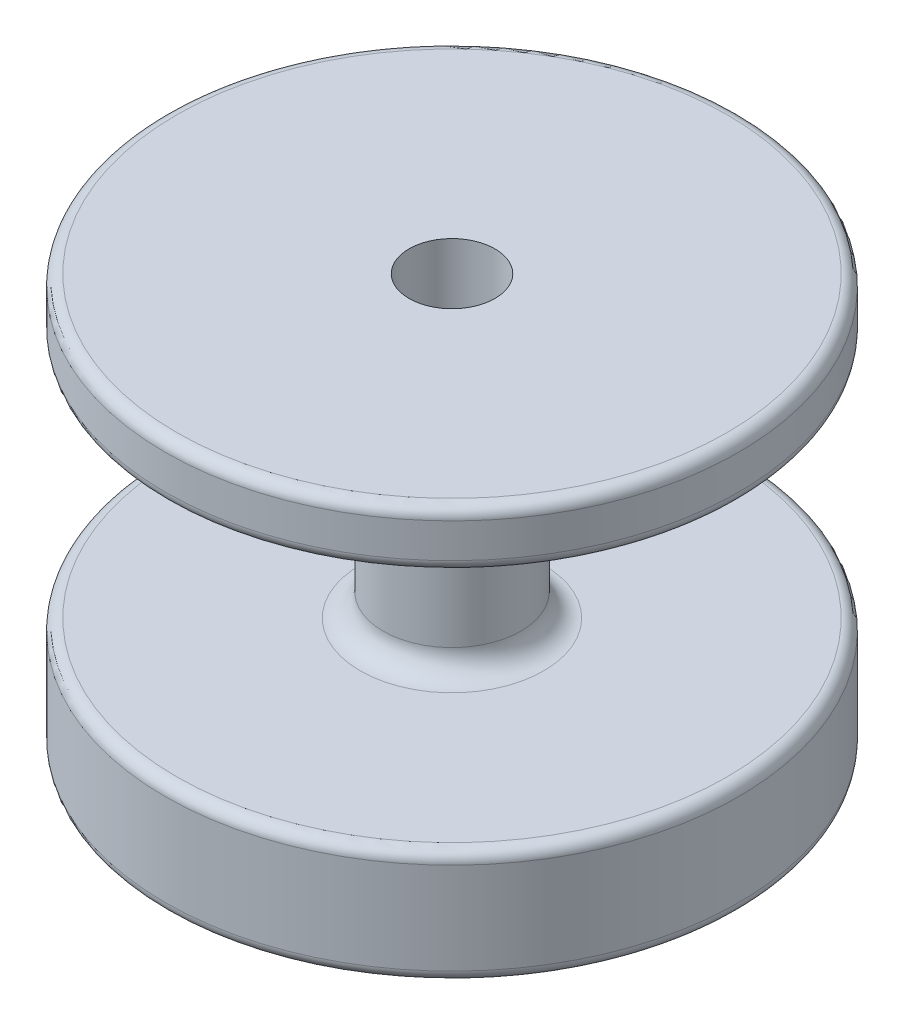
ISO-10303-21;
HEADER;
FILE_DESCRIPTION(('STEP AP214'),'2;1');
FILE_NAME('part.step','',(''),(''),'','','');
FILE_SCHEMA(('AUTOMOTIVE_DESIGN { 1 0 10303 214 1 1 1 1 }'));
ENDSEC;
DATA;
#1=APPLICATION_CONTEXT('core data for automotive mechanical design processes');
#2=APPLICATION_PROTOCOL_DEFINITION('international standard','automotive_design',2000,#1);
#3=PRODUCT_CONTEXT('',#1,'mechanical');
#4=PRODUCT('Part','Part','',(#3));
#5=PRODUCT_RELATED_PRODUCT_CATEGORY('part','',(#4));
#6=PRODUCT_DEFINITION_FORMATION('','',#4);
#7=PRODUCT_DEFINITION_CONTEXT('part definition',#1,'design');
#8=PRODUCT_DEFINITION('design','',#6,#7);
#9=PRODUCT_DEFINITION_SHAPE('','',#8);
#10=(LENGTH_UNIT() NAMED_UNIT(*) SI_UNIT(.MILLI.,.METRE.));
#11=(NAMED_UNIT(*) PLANE_ANGLE_UNIT() SI_UNIT($,.RADIAN.));
#12=(NAMED_UNIT(*) SI_UNIT($,.STERADIAN.) SOLID_ANGLE_UNIT());
#13=UNCERTAINTY_MEASURE_WITH_UNIT(LENGTH_MEASURE(1.E-05),#10,'distance_accuracy_value','');
#14=(GEOMETRIC_REPRESENTATION_CONTEXT(3) GLOBAL_UNCERTAINTY_ASSIGNED_CONTEXT((#13)) GLOBAL_UNIT_ASSIGNED_CONTEXT((#10,
#11,#12)) REPRESENTATION_CONTEXT('',''));
#15=CARTESIAN_POINT('',(0.,0.,0.));
#16=DIRECTION('',(0.,0.,1.));
#17=DIRECTION('',(1.,0.,0.));
#18=AXIS2_PLACEMENT_3D('',#15,#16,#17);
#19=CARTESIAN_POINT('',(0.,47.,0.));
#20=DIRECTION('',(0.,-1.,0.));
#21=DIRECTION('',(0.,0.,-1.));
#22=AXIS2_PLACEMENT_3D('',#19,#20,#21);
#23=CYLINDRICAL_SURFACE('',#22,2.);
#24=CARTESIAN_POINT('',(0.,0.,0.));
#25=DIRECTION('',(0.,1.,0.));
#26=DIRECTION('',(0.,0.,1.));
#27=AXIS2_PLACEMENT_3D('',#24,#25,#26);
#28=CIRCLE('',#27,2.);
#29=CARTESIAN_POINT('',(0.,0.,2.));
#30=VERTEX_POINT('',#29);
#31=EDGE_CURVE('E95',#30,#30,#28,.F.);
#32=ORIENTED_EDGE('',*,*,#31,.T.);
#33=EDGE_LOOP('',(#32));
#34=FACE_BOUND('',#33,.T.);
#35=CARTESIAN_POINT('',(0.,19.,0.));
#36=DIRECTION('',(0.,1.,0.));
#37=DIRECTION('',(0.,0.,1.));
#38=AXIS2_PLACEMENT_3D('',#35,#36,#37);
#39=CIRCLE('',#38,2.);
#40=CARTESIAN_POINT('',(0.,19.,2.));
#41=VERTEX_POINT('',#40);
#42=EDGE_CURVE('E96',#41,#41,#39,.T.);
#43=ORIENTED_EDGE('',*,*,#42,.T.);
#44=EDGE_LOOP('',(#43));
#45=FACE_BOUND('',#44,.T.);
#46=ADVANCED_FACE('F39',(#34,#45),#23,.F.);
#47=CARTESIAN_POINT('',(0.,36.,0.));
#48=DIRECTION('',(0.,-1.,0.));
#49=DIRECTION('',(0.,0.,-1.));
#50=AXIS2_PLACEMENT_3D('',#47,#48,#49);
#51=CYLINDRICAL_SURFACE('',#50,25.);
#52=CARTESIAN_POINT('',(0.,35.,0.));
#53=DIRECTION('',(0.,1.,0.));
#54=DIRECTION('',(0.,0.,1.));
#55=AXIS2_PLACEMENT_3D('',#52,#53,#54);
#56=CIRCLE('',#55,25.);
#57=CARTESIAN_POINT('',(0.,35.,25.));
#58=VERTEX_POINT('',#57);
#59=EDGE_CURVE('E83',#58,#58,#56,.F.);
#60=ORIENTED_EDGE('',*,*,#59,.T.);
#61=EDGE_LOOP('',(#60));
#62=FACE_BOUND('',#61,.T.);
#63=CARTESIAN_POINT('',(0.,32.,0.));
#64=DIRECTION('',(0.,1.,0.));
#65=DIRECTION('',(0.,0.,1.));
#66=AXIS2_PLACEMENT_3D('',#63,#64,#65);
#67=CIRCLE('',#66,25.);
#68=CARTESIAN_POINT('',(0.,32.,25.));
#69=VERTEX_POINT('',#68);
#70=EDGE_CURVE('E87',#69,#69,#67,.T.);
#71=ORIENTED_EDGE('',*,*,#70,.T.);
#72=EDGE_LOOP('',(#71));
#73=FACE_BOUND('',#72,.T.);
#74=ADVANCED_FACE('F124',(#62,#73),#51,.T.);
#75=CARTESIAN_POINT('',(0.,36.,0.));
#76=DIRECTION('',(0.,1.,0.));
#77=DIRECTION('',(0.,0.,1.));
#78=AXIS2_PLACEMENT_3D('',#75,#76,#77);
#79=PLANE('',#78);
#80=CARTESIAN_POINT('',(0.,36.,0.));
#81=DIRECTION('',(0.,1.,0.));
#82=DIRECTION('',(0.,0.,1.));
#83=AXIS2_PLACEMENT_3D('',#80,#81,#82);
#84=CIRCLE('',#83,24.);
#85=CARTESIAN_POINT('',(0.,36.,24.));
#86=VERTEX_POINT('',#85);
#87=EDGE_CURVE('E91',#86,#86,#84,.T.);
#88=ORIENTED_EDGE('',*,*,#87,.T.);
#89=EDGE_LOOP('',(#88));
#90=FACE_BOUND('',#89,.T.);
#91=CARTESIAN_POINT('',(0.,36.,0.));
#92=DIRECTION('',(0.,1.,0.));
#93=DIRECTION('',(0.,0.,1.));
#94=AXIS2_PLACEMENT_3D('',#91,#92,#93);
#95=CIRCLE('',#94,3.75);
#96=CARTESIAN_POINT('',(0.,36.,3.75));
#97=VERTEX_POINT('',#96);
#98=EDGE_CURVE('E104',#97,#97,#95,.T.);
#99=ORIENTED_EDGE('',*,*,#98,.F.);
#100=EDGE_LOOP('',(#99));
#101=FACE_BOUND('',#100,.T.);
#102=ADVANCED_FACE('F121',(#90,#101),#79,.T.);
#103=CARTESIAN_POINT('',(0.,31.,0.));
#104=DIRECTION('',(0.,-1.,0.));
#105=DIRECTION('',(0.,0.,-1.));
#106=AXIS2_PLACEMENT_3D('',#103,#104,#105);
#107=CYLINDRICAL_SURFACE('',#106,6.);
#108=CARTESIAN_POINT('',(0.,29.,0.));
#109=DIRECTION('',(0.,1.,0.));
#110=DIRECTION('',(0.,0.,1.));
#111=AXIS2_PLACEMENT_3D('',#108,#109,#110);
#112=CIRCLE('',#111,6.);
#113=CARTESIAN_POINT('',(0.,29.,6.));
#114=VERTEX_POINT('',#113);
#115=EDGE_CURVE('E47',#114,#114,#112,.F.);
#116=ORIENTED_EDGE('',*,*,#115,.T.);
#117=EDGE_LOOP('',(#116));
#118=FACE_BOUND('',#117,.T.);
#119=CARTESIAN_POINT('',(0.,12.,0.));
#120=DIRECTION('',(0.,1.,0.));
#121=DIRECTION('',(0.,0.,1.));
#122=AXIS2_PLACEMENT_3D('',#119,#120,#121);
#123=CIRCLE('',#122,6.);
#124=CARTESIAN_POINT('',(0.,12.,6.));
#125=VERTEX_POINT('',#124);
#126=EDGE_CURVE('E52',#125,#125,#123,.T.);
#127=ORIENTED_EDGE('',*,*,#126,.T.);
#128=EDGE_LOOP('',(#127));
#129=FACE_BOUND('',#128,.T.);
#130=ADVANCED_FACE('F123',(#118,#129),#107,.T.);
#131=CARTESIAN_POINT('',(0.,31.,0.));
#132=DIRECTION('',(0.,1.,0.));
#133=DIRECTION('',(0.,0.,1.));
#134=AXIS2_PLACEMENT_3D('',#131,#132,#133);
#135=PLANE('',#134);
#136=CARTESIAN_POINT('',(0.,31.,0.));
#137=DIRECTION('',(0.,1.,0.));
#138=DIRECTION('',(0.,0.,1.));
#139=AXIS2_PLACEMENT_3D('',#136,#137,#138);
#140=CIRCLE('',#139,8.);
#141=CARTESIAN_POINT('',(0.,31.,8.));
#142=VERTEX_POINT('',#141);
#143=EDGE_CURVE('E57',#142,#142,#140,.T.);
#144=ORIENTED_EDGE('',*,*,#143,.T.);
#145=EDGE_LOOP('',(#144));
#146=FACE_BOUND('',#145,.T.);
#147=CARTESIAN_POINT('',(0.,31.,0.));
#148=DIRECTION('',(0.,1.,0.));
#149=DIRECTION('',(0.,0.,1.));
#150=AXIS2_PLACEMENT_3D('',#147,#148,#149);
#151=CIRCLE('',#150,24.);
#152=CARTESIAN_POINT('',(0.,31.,24.));
#153=VERTEX_POINT('',#152);
#154=EDGE_CURVE('E79',#153,#153,#151,.F.);
#155=ORIENTED_EDGE('',*,*,#154,.T.);
#156=EDGE_LOOP('',(#155));
#157=FACE_BOUND('',#156,.T.);
#158=ADVANCED_FACE('F131',(#146,#157),#135,.F.);
#159=CARTESIAN_POINT('',(0.,10.,0.));
#160=DIRECTION('',(0.,1.,0.));
#161=DIRECTION('',(0.,0.,1.));
#162=AXIS2_PLACEMENT_3D('',#159,#160,#161);
#163=PLANE('',#162);
#164=CARTESIAN_POINT('',(0.,10.,0.));
#165=DIRECTION('',(0.,1.,0.));
#166=DIRECTION('',(0.,0.,1.));
#167=AXIS2_PLACEMENT_3D('',#164,#165,#166);
#168=CIRCLE('',#167,8.);
#169=CARTESIAN_POINT('',(0.,10.,8.));
#170=VERTEX_POINT('',#169);
#171=EDGE_CURVE('E10',#170,#170,#168,.F.);
#172=ORIENTED_EDGE('',*,*,#171,.T.);
#173=EDGE_LOOP('',(#172));
#174=FACE_BOUND('',#173,.T.);
#175=CARTESIAN_POINT('',(0.,10.,0.));
#176=DIRECTION('',(0.,1.,0.));
#177=DIRECTION('',(0.,0.,1.));
#178=AXIS2_PLACEMENT_3D('',#175,#176,#177);
#179=CIRCLE('',#178,24.);
#180=CARTESIAN_POINT('',(0.,10.,24.));
#181=VERTEX_POINT('',#180);
#182=EDGE_CURVE('E75',#181,#181,#179,.T.);
#183=ORIENTED_EDGE('',*,*,#182,.T.);
#184=EDGE_LOOP('',(#183));
#185=FACE_BOUND('',#184,.T.);
#186=ADVANCED_FACE('F146',(#174,#185),#163,.T.);
#187=CARTESIAN_POINT('',(0.,0.,0.));
#188=DIRECTION('',(0.,1.,0.));
#189=DIRECTION('',(0.,0.,1.));
#190=AXIS2_PLACEMENT_3D('',#187,#188,#189);
#191=PLANE('',#190);
#192=CARTESIAN_POINT('',(0.,0.,0.));
#193=DIRECTION('',(0.,1.,0.));
#194=DIRECTION('',(0.,0.,1.));
#195=AXIS2_PLACEMENT_3D('',#192,#193,#194);
#196=CIRCLE('',#195,24.);
#197=CARTESIAN_POINT('',(0.,0.,24.));
#198=VERTEX_POINT('',#197);
#199=EDGE_CURVE('E63',#198,#198,#196,.F.);
#200=ORIENTED_EDGE('',*,*,#199,.T.);
#201=EDGE_LOOP('',(#200));
#202=FACE_BOUND('',#201,.T.);
#203=ORIENTED_EDGE('',*,*,#31,.F.);
#204=EDGE_LOOP('',(#203));
#205=FACE_BOUND('',#204,.T.);
#206=ADVANCED_FACE('F149',(#202,#205),#191,.F.);
#207=CARTESIAN_POINT('',(0.,9.,0.));
#208=DIRECTION('',(0.,1.,0.));
#209=DIRECTION('',(0.,0.,1.));
#210=AXIS2_PLACEMENT_3D('',#207,#208,#209);
#211=CIRCLE('',#210,25.);
#212=CARTESIAN_POINT('',(0.,9.,25.));
#213=VERTEX_POINT('',#212);
#214=EDGE_CURVE('E67',#213,#213,#211,.F.);
#215=ORIENTED_EDGE('',*,*,#214,.T.);
#216=EDGE_LOOP('',(#215));
#217=FACE_BOUND('',#216,.T.);
#218=CARTESIAN_POINT('',(0.,1.,0.));
#219=DIRECTION('',(0.,1.,0.));
#220=DIRECTION('',(0.,0.,1.));
#221=AXIS2_PLACEMENT_3D('',#218,#219,#220);
#222=CIRCLE('',#221,25.);
#223=CARTESIAN_POINT('',(0.,1.,25.));
#224=VERTEX_POINT('',#223);
#225=EDGE_CURVE('E71',#224,#224,#222,.T.);
#226=ORIENTED_EDGE('',*,*,#225,.T.);
#227=EDGE_LOOP('',(#226));
#228=FACE_BOUND('',#227,.T.);
#229=ADVANCED_FACE('F117',(#217,#228),#51,.T.);
#230=CARTESIAN_POINT('',(0.,19.,0.));
#231=DIRECTION('',(0.,1.,0.));
#232=DIRECTION('',(0.,0.,1.));
#233=AXIS2_PLACEMENT_3D('',#230,#231,#232);
#234=CYLINDRICAL_SURFACE('',#233,3.75);
#235=CARTESIAN_POINT('',(0.,19.,0.));
#236=DIRECTION('',(0.,1.,0.));
#237=DIRECTION('',(0.,0.,1.));
#238=AXIS2_PLACEMENT_3D('',#235,#236,#237);
#239=CIRCLE('',#238,3.75);
#240=CARTESIAN_POINT('',(0.,19.,3.75));
#241=VERTEX_POINT('',#240);
#242=EDGE_CURVE('E100',#241,#241,#239,.T.);
#243=ORIENTED_EDGE('',*,*,#242,.F.);
#244=EDGE_LOOP('',(#243));
#245=FACE_BOUND('',#244,.T.);
#246=ORIENTED_EDGE('',*,*,#98,.T.);
#247=EDGE_LOOP('',(#246));
#248=FACE_BOUND('',#247,.T.);
#249=ADVANCED_FACE('F114',(#245,#248),#234,.F.);
#250=CARTESIAN_POINT('',(0.,19.,0.));
#251=DIRECTION('',(0.,1.,0.));
#252=DIRECTION('',(0.,0.,1.));
#253=AXIS2_PLACEMENT_3D('',#250,#251,#252);
#254=PLANE('',#253);
#255=ORIENTED_EDGE('',*,*,#42,.F.);
#256=EDGE_LOOP('',(#255));
#257=FACE_BOUND('',#256,.T.);
#258=ORIENTED_EDGE('',*,*,#242,.T.);
#259=EDGE_LOOP('',(#258));
#260=FACE_BOUND('',#259,.T.);
#261=ADVANCED_FACE('F112',(#257,#260),#254,.T.);
#262=CARTESIAN_POINT('',(0.,35.,0.));
#263=DIRECTION('',(0.,1.,0.));
#264=DIRECTION('',(0.,0.,1.));
#265=AXIS2_PLACEMENT_3D('',#262,#263,#264);
#266=TOROIDAL_SURFACE('',#265,24.,1.);
#267=ORIENTED_EDGE('',*,*,#59,.F.);
#268=EDGE_LOOP('',(#267));
#269=FACE_BOUND('',#268,.T.);
#270=ORIENTED_EDGE('',*,*,#87,.F.);
#271=EDGE_LOOP('',(#270));
#272=FACE_BOUND('',#271,.T.);
#273=ADVANCED_FACE('F170',(#269,#272),#266,.T.);
#274=CARTESIAN_POINT('',(0.,32.,0.));
#275=DIRECTION('',(0.,1.,0.));
#276=DIRECTION('',(0.,0.,1.));
#277=AXIS2_PLACEMENT_3D('',#274,#275,#276);
#278=TOROIDAL_SURFACE('',#277,24.,1.);
#279=ORIENTED_EDGE('',*,*,#154,.F.);
#280=EDGE_LOOP('',(#279));
#281=FACE_BOUND('',#280,.T.);
#282=ORIENTED_EDGE('',*,*,#70,.F.);
#283=EDGE_LOOP('',(#282));
#284=FACE_BOUND('',#283,.T.);
#285=ADVANCED_FACE('F160',(#281,#284),#278,.T.);
#286=CARTESIAN_POINT('',(0.,9.,0.));
#287=DIRECTION('',(0.,1.,0.));
#288=DIRECTION('',(0.,0.,1.));
#289=AXIS2_PLACEMENT_3D('',#286,#287,#288);
#290=TOROIDAL_SURFACE('',#289,24.,1.);
#291=ORIENTED_EDGE('',*,*,#214,.F.);
#292=EDGE_LOOP('',(#291));
#293=FACE_BOUND('',#292,.T.);
#294=ORIENTED_EDGE('',*,*,#182,.F.);
#295=EDGE_LOOP('',(#294));
#296=FACE_BOUND('',#295,.T.);
#297=ADVANCED_FACE('F157',(#293,#296),#290,.T.);
#298=CARTESIAN_POINT('',(0.,1.,0.));
#299=DIRECTION('',(0.,1.,0.));
#300=DIRECTION('',(0.,0.,1.));
#301=AXIS2_PLACEMENT_3D('',#298,#299,#300);
#302=TOROIDAL_SURFACE('',#301,24.,1.);
#303=ORIENTED_EDGE('',*,*,#199,.F.);
#304=EDGE_LOOP('',(#303));
#305=FACE_BOUND('',#304,.T.);
#306=ORIENTED_EDGE('',*,*,#225,.F.);
#307=EDGE_LOOP('',(#306));
#308=FACE_BOUND('',#307,.T.);
#309=ADVANCED_FACE('F159',(#305,#308),#302,.T.);
#310=CARTESIAN_POINT('',(0.,29.,0.));
#311=DIRECTION('',(0.,1.,0.));
#312=DIRECTION('',(0.,0.,1.));
#313=AXIS2_PLACEMENT_3D('',#310,#311,#312);
#314=TOROIDAL_SURFACE('',#313,8.,2.);
#315=ORIENTED_EDGE('',*,*,#115,.F.);
#316=EDGE_LOOP('',(#315));
#317=FACE_BOUND('',#316,.T.);
#318=ORIENTED_EDGE('',*,*,#143,.F.);
#319=EDGE_LOOP('',(#318));
#320=FACE_BOUND('',#319,.T.);
#321=ADVANCED_FACE('F167',(#317,#320),#314,.F.);
#322=CARTESIAN_POINT('',(0.,12.,0.));
#323=DIRECTION('',(0.,1.,0.));
#324=DIRECTION('',(0.,0.,1.));
#325=AXIS2_PLACEMENT_3D('',#322,#323,#324);
#326=TOROIDAL_SURFACE('',#325,8.,2.);
#327=ORIENTED_EDGE('',*,*,#171,.F.);
#328=EDGE_LOOP('',(#327));
#329=FACE_BOUND('',#328,.T.);
#330=ORIENTED_EDGE('',*,*,#126,.F.);
#331=EDGE_LOOP('',(#330));
#332=FACE_BOUND('',#331,.T.);
#333=ADVANCED_FACE('F41',(#329,#332),#326,.F.);
#334=CLOSED_SHELL('',(#46,#74,#102,#130,#158,#186,#206,#229,#249,#261,#273,#285,#297,#309,#321,#333));
#335=MANIFOLD_SOLID_BREP('B2',#334);
#336=ADVANCED_BREP_SHAPE_REPRESENTATION('',(#18,#335),#14);
#337=SHAPE_DEFINITION_REPRESENTATION(#9,#336);
ENDSEC;
END-ISO-10303-21;
